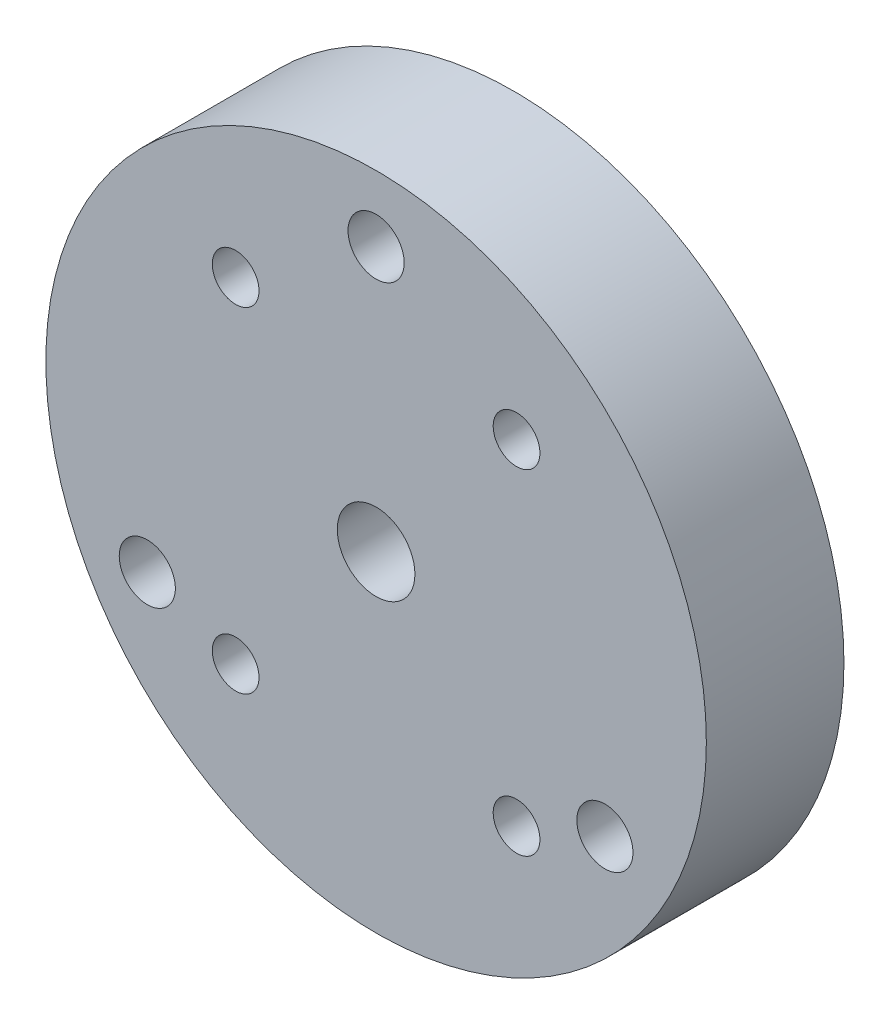
ISO-10303-21;
HEADER;
FILE_DESCRIPTION(('STEP AP214'),'2;1');
FILE_NAME('part.step','',(''),(''),'','','');
FILE_SCHEMA(('AUTOMOTIVE_DESIGN { 1 0 10303 214 1 1 1 1 }'));
ENDSEC;
DATA;
#1=APPLICATION_CONTEXT('core data for automotive mechanical design processes');
#2=APPLICATION_PROTOCOL_DEFINITION('international standard','automotive_design',2000,#1);
#3=PRODUCT_CONTEXT('',#1,'mechanical');
#4=PRODUCT('Part','Part','',(#3));
#5=PRODUCT_RELATED_PRODUCT_CATEGORY('part','',(#4));
#6=PRODUCT_DEFINITION_FORMATION('','',#4);
#7=PRODUCT_DEFINITION_CONTEXT('part definition',#1,'design');
#8=PRODUCT_DEFINITION('design','',#6,#7);
#9=PRODUCT_DEFINITION_SHAPE('','',#8);
#10=(LENGTH_UNIT() NAMED_UNIT(*) SI_UNIT(.MILLI.,.METRE.));
#11=(NAMED_UNIT(*) PLANE_ANGLE_UNIT() SI_UNIT($,.RADIAN.));
#12=(NAMED_UNIT(*) SI_UNIT($,.STERADIAN.) SOLID_ANGLE_UNIT());
#13=UNCERTAINTY_MEASURE_WITH_UNIT(LENGTH_MEASURE(1.E-05),#10,'distance_accuracy_value','');
#14=(GEOMETRIC_REPRESENTATION_CONTEXT(3) GLOBAL_UNCERTAINTY_ASSIGNED_CONTEXT((#13)) GLOBAL_UNIT_ASSIGNED_CONTEXT((#10,
#11,#12)) REPRESENTATION_CONTEXT('',''));
#15=CARTESIAN_POINT('',(0.,0.,0.));
#16=DIRECTION('',(0.,0.,1.));
#17=DIRECTION('',(1.,0.,0.));
#18=AXIS2_PLACEMENT_3D('',#15,#16,#17);
#19=CARTESIAN_POINT('',(0.,0.,25.));
#20=DIRECTION('',(0.,0.,1.));
#21=DIRECTION('',(1.,0.,0.));
#22=AXIS2_PLACEMENT_3D('',#19,#20,#21);
#23=PLANE('',#22);
#24=CARTESIAN_POINT('',(-41.5692193816529,-24.0000000000002,25.));
#25=DIRECTION('',(0.,0.,-1.));
#26=DIRECTION('',(-1.,0.,0.));
#27=AXIS2_PLACEMENT_3D('',#24,#25,#26);
#28=CIRCLE('',#27,5.09999999999999);
#29=CARTESIAN_POINT('',(-46.6692193816529,-24.0000000000002,25.));
#30=VERTEX_POINT('',#29);
#31=EDGE_CURVE('E388',#30,#30,#28,.T.);
#32=ORIENTED_EDGE('',*,*,#31,.T.);
#33=EDGE_LOOP('',(#32));
#34=FACE_BOUND('',#33,.T.);
#35=CARTESIAN_POINT('',(25.5186681045557,30.4119643918234,25.));
#36=DIRECTION('',(0.,0.,-1.));
#37=DIRECTION('',(-1.,0.,0.));
#38=AXIS2_PLACEMENT_3D('',#35,#36,#37);
#39=CIRCLE('',#38,4.24999999999999);
#40=CARTESIAN_POINT('',(21.2686681045557,30.4119643918234,25.));
#41=VERTEX_POINT('',#40);
#42=EDGE_CURVE('E400',#41,#41,#39,.T.);
#43=ORIENTED_EDGE('',*,*,#42,.T.);
#44=EDGE_LOOP('',(#43));
#45=FACE_BOUND('',#44,.T.);
#46=CARTESIAN_POINT('',(25.5186681045555,-30.4119643918236,25.));
#47=DIRECTION('',(0.,0.,-1.));
#48=DIRECTION('',(-1.,0.,0.));
#49=AXIS2_PLACEMENT_3D('',#46,#47,#48);
#50=CIRCLE('',#49,4.24999999999999);
#51=CARTESIAN_POINT('',(21.2686681045555,-30.4119643918236,25.));
#52=VERTEX_POINT('',#51);
#53=EDGE_CURVE('E412',#52,#52,#50,.T.);
#54=ORIENTED_EDGE('',*,*,#53,.T.);
#55=EDGE_LOOP('',(#54));
#56=FACE_BOUND('',#55,.T.);
#57=CARTESIAN_POINT('',(0.,0.,25.));
#58=DIRECTION('',(0.,0.,1.));
#59=DIRECTION('',(1.,0.,0.));
#60=AXIS2_PLACEMENT_3D('',#57,#58,#59);
#61=CIRCLE('',#60,7.05);
#62=CARTESIAN_POINT('',(7.05,0.,25.));
#63=VERTEX_POINT('',#62);
#64=EDGE_CURVE('E359',#63,#63,#61,.T.);
#65=ORIENTED_EDGE('',*,*,#64,.F.);
#66=EDGE_LOOP('',(#65));
#67=FACE_BOUND('',#66,.T.);
#68=CARTESIAN_POINT('',(0.,0.,25.));
#69=DIRECTION('',(0.,0.,1.));
#70=DIRECTION('',(1.,0.,0.));
#71=AXIS2_PLACEMENT_3D('',#68,#69,#70);
#72=CIRCLE('',#71,60.);
#73=CARTESIAN_POINT('',(60.,0.,25.));
#74=VERTEX_POINT('',#73);
#75=EDGE_CURVE('E10',#74,#74,#72,.T.);
#76=ORIENTED_EDGE('',*,*,#75,.T.);
#77=EDGE_LOOP('',(#76));
#78=FACE_BOUND('',#77,.T.);
#79=CARTESIAN_POINT('',(-25.5186681045557,-30.4119643918234,25.));
#80=DIRECTION('',(0.,0.,-1.));
#81=DIRECTION('',(-1.,0.,0.));
#82=AXIS2_PLACEMENT_3D('',#79,#80,#81);
#83=CIRCLE('',#82,4.24999999999999);
#84=CARTESIAN_POINT('',(-29.7686681045557,-30.4119643918234,25.));
#85=VERTEX_POINT('',#84);
#86=EDGE_CURVE('E418',#85,#85,#83,.T.);
#87=ORIENTED_EDGE('',*,*,#86,.T.);
#88=EDGE_LOOP('',(#87));
#89=FACE_BOUND('',#88,.T.);
#90=CARTESIAN_POINT('',(-25.5186681045554,30.4119643918236,25.));
#91=DIRECTION('',(0.,0.,-1.));
#92=DIRECTION('',(-1.,0.,0.));
#93=AXIS2_PLACEMENT_3D('',#90,#91,#92);
#94=CIRCLE('',#93,4.24999999999999);
#95=CARTESIAN_POINT('',(-29.7686681045554,30.4119643918236,25.));
#96=VERTEX_POINT('',#95);
#97=EDGE_CURVE('E406',#96,#96,#94,.T.);
#98=ORIENTED_EDGE('',*,*,#97,.T.);
#99=EDGE_LOOP('',(#98));
#100=FACE_BOUND('',#99,.T.);
#101=CARTESIAN_POINT('',(41.5692193816529,-24.0000000000002,25.));
#102=DIRECTION('',(0.,0.,-1.));
#103=DIRECTION('',(-1.,0.,0.));
#104=AXIS2_PLACEMENT_3D('',#101,#102,#103);
#105=CIRCLE('',#104,5.09999999999999);
#106=CARTESIAN_POINT('',(36.4692193816529,-24.0000000000002,25.));
#107=VERTEX_POINT('',#106);
#108=EDGE_CURVE('E394',#107,#107,#105,.T.);
#109=ORIENTED_EDGE('',*,*,#108,.T.);
#110=EDGE_LOOP('',(#109));
#111=FACE_BOUND('',#110,.T.);
#112=CARTESIAN_POINT('',(0.,48.,25.));
#113=DIRECTION('',(0.,0.,-1.));
#114=DIRECTION('',(-1.,0.,0.));
#115=AXIS2_PLACEMENT_3D('',#112,#113,#114);
#116=CIRCLE('',#115,5.09999999999999);
#117=CARTESIAN_POINT('',(-5.09999999999999,48.,25.));
#118=VERTEX_POINT('',#117);
#119=EDGE_CURVE('E380',#118,#118,#116,.T.);
#120=ORIENTED_EDGE('',*,*,#119,.T.);
#121=EDGE_LOOP('',(#120));
#122=FACE_BOUND('',#121,.T.);
#123=ADVANCED_FACE('F346',(#34,#45,#56,#67,#78,#89,#100,#111,#122),#23,.T.);
#124=CARTESIAN_POINT('',(0.,0.,25.));
#125=DIRECTION('',(0.,0.,-1.));
#126=DIRECTION('',(-1.,0.,0.));
#127=AXIS2_PLACEMENT_3D('',#124,#125,#126);
#128=CYLINDRICAL_SURFACE('',#127,7.05);
#129=ORIENTED_EDGE('',*,*,#64,.T.);
#130=EDGE_LOOP('',(#129));
#131=FACE_BOUND('',#130,.T.);
#132=CARTESIAN_POINT('',(0.,0.,2.4));
#133=DIRECTION('',(0.,0.,-1.));
#134=DIRECTION('',(-1.,0.,0.));
#135=AXIS2_PLACEMENT_3D('',#132,#133,#134);
#136=CIRCLE('',#135,7.05);
#137=CARTESIAN_POINT('',(-7.05,0.,2.4));
#138=VERTEX_POINT('',#137);
#139=EDGE_CURVE('E363',#138,#138,#136,.T.);
#140=ORIENTED_EDGE('',*,*,#139,.T.);
#141=EDGE_LOOP('',(#140));
#142=FACE_BOUND('',#141,.T.);
#143=ADVANCED_FACE('F431',(#131,#142),#128,.F.);
#144=CARTESIAN_POINT('',(0.,0.,0.));
#145=DIRECTION('',(0.,0.,1.));
#146=DIRECTION('',(1.,0.,0.));
#147=AXIS2_PLACEMENT_3D('',#144,#145,#146);
#148=PLANE('',#147);
#149=CARTESIAN_POINT('',(0.,48.,0.));
#150=DIRECTION('',(0.,0.,-1.));
#151=DIRECTION('',(-1.,0.,0.));
#152=AXIS2_PLACEMENT_3D('',#149,#150,#151);
#153=CIRCLE('',#152,5.09999999999999);
#154=CARTESIAN_POINT('',(-5.09999999999999,48.,0.));
#155=VERTEX_POINT('',#154);
#156=EDGE_CURVE('E385',#155,#155,#153,.T.);
#157=ORIENTED_EDGE('',*,*,#156,.F.);
#158=EDGE_LOOP('',(#157));
#159=FACE_BOUND('',#158,.T.);
#160=CARTESIAN_POINT('',(-41.5692193816529,-24.0000000000002,0.));
#161=DIRECTION('',(0.,0.,-1.));
#162=DIRECTION('',(-1.,0.,0.));
#163=AXIS2_PLACEMENT_3D('',#160,#161,#162);
#164=CIRCLE('',#163,5.09999999999999);
#165=CARTESIAN_POINT('',(-46.6692193816529,-24.0000000000002,0.));
#166=VERTEX_POINT('',#165);
#167=EDGE_CURVE('E391',#166,#166,#164,.T.);
#168=ORIENTED_EDGE('',*,*,#167,.F.);
#169=EDGE_LOOP('',(#168));
#170=FACE_BOUND('',#169,.T.);
#171=CARTESIAN_POINT('',(41.5692193816529,-24.0000000000002,0.));
#172=DIRECTION('',(0.,0.,-1.));
#173=DIRECTION('',(-1.,0.,0.));
#174=AXIS2_PLACEMENT_3D('',#171,#172,#173);
#175=CIRCLE('',#174,5.09999999999999);
#176=CARTESIAN_POINT('',(36.469219381653,-24.0000000000002,0.));
#177=VERTEX_POINT('',#176);
#178=EDGE_CURVE('E397',#177,#177,#175,.T.);
#179=ORIENTED_EDGE('',*,*,#178,.F.);
#180=EDGE_LOOP('',(#179));
#181=FACE_BOUND('',#180,.T.);
#182=CARTESIAN_POINT('',(25.5186681045557,30.4119643918234,0.));
#183=DIRECTION('',(0.,0.,-1.));
#184=DIRECTION('',(-1.,0.,0.));
#185=AXIS2_PLACEMENT_3D('',#182,#183,#184);
#186=CIRCLE('',#185,4.24999999999999);
#187=CARTESIAN_POINT('',(21.2686681045557,30.4119643918234,0.));
#188=VERTEX_POINT('',#187);
#189=EDGE_CURVE('E403',#188,#188,#186,.T.);
#190=ORIENTED_EDGE('',*,*,#189,.F.);
#191=EDGE_LOOP('',(#190));
#192=FACE_BOUND('',#191,.T.);
#193=CARTESIAN_POINT('',(-25.5186681045554,30.4119643918236,0.));
#194=DIRECTION('',(0.,0.,-1.));
#195=DIRECTION('',(-1.,0.,0.));
#196=AXIS2_PLACEMENT_3D('',#193,#194,#195);
#197=CIRCLE('',#196,4.24999999999999);
#198=CARTESIAN_POINT('',(-29.7686681045554,30.4119643918236,0.));
#199=VERTEX_POINT('',#198);
#200=EDGE_CURVE('E409',#199,#199,#197,.T.);
#201=ORIENTED_EDGE('',*,*,#200,.F.);
#202=EDGE_LOOP('',(#201));
#203=FACE_BOUND('',#202,.T.);
#204=CARTESIAN_POINT('',(25.5186681045555,-30.4119643918236,0.));
#205=DIRECTION('',(0.,0.,-1.));
#206=DIRECTION('',(-1.,0.,0.));
#207=AXIS2_PLACEMENT_3D('',#204,#205,#206);
#208=CIRCLE('',#207,4.24999999999999);
#209=CARTESIAN_POINT('',(21.2686681045555,-30.4119643918236,0.));
#210=VERTEX_POINT('',#209);
#211=EDGE_CURVE('E415',#210,#210,#208,.T.);
#212=ORIENTED_EDGE('',*,*,#211,.F.);
#213=EDGE_LOOP('',(#212));
#214=FACE_BOUND('',#213,.T.);
#215=CARTESIAN_POINT('',(-25.5186681045557,-30.4119643918234,0.));
#216=DIRECTION('',(0.,0.,-1.));
#217=DIRECTION('',(-1.,0.,0.));
#218=AXIS2_PLACEMENT_3D('',#215,#216,#217);
#219=CIRCLE('',#218,4.24999999999999);
#220=CARTESIAN_POINT('',(-29.7686681045557,-30.4119643918234,0.));
#221=VERTEX_POINT('',#220);
#222=EDGE_CURVE('E421',#221,#221,#219,.T.);
#223=ORIENTED_EDGE('',*,*,#222,.F.);
#224=EDGE_LOOP('',(#223));
#225=FACE_BOUND('',#224,.T.);
#226=CARTESIAN_POINT('',(0.,0.,0.));
#227=DIRECTION('',(0.,0.,-1.));
#228=DIRECTION('',(-1.,0.,0.));
#229=AXIS2_PLACEMENT_3D('',#226,#227,#228);
#230=CIRCLE('',#229,30.15);
#231=CARTESIAN_POINT('',(-30.15,0.,0.));
#232=VERTEX_POINT('',#231);
#233=EDGE_CURVE('E424',#232,#232,#230,.T.);
#234=ORIENTED_EDGE('',*,*,#233,.F.);
#235=EDGE_LOOP('',(#234));
#236=FACE_BOUND('',#235,.T.);
#237=CARTESIAN_POINT('',(0.,0.,0.));
#238=DIRECTION('',(0.,0.,1.));
#239=DIRECTION('',(1.,0.,0.));
#240=AXIS2_PLACEMENT_3D('',#237,#238,#239);
#241=CIRCLE('',#240,60.);
#242=CARTESIAN_POINT('',(60.,0.,0.));
#243=VERTEX_POINT('',#242);
#244=EDGE_CURVE('E354',#243,#243,#241,.T.);
#245=ORIENTED_EDGE('',*,*,#244,.F.);
#246=EDGE_LOOP('',(#245));
#247=FACE_BOUND('',#246,.T.);
#248=ADVANCED_FACE('F453',(#159,#170,#181,#192,#203,#214,#225,#236,#247),#148,.F.);
#249=CARTESIAN_POINT('',(0.,0.,25.));
#250=DIRECTION('',(0.,0.,-1.));
#251=DIRECTION('',(-1.,0.,0.));
#252=AXIS2_PLACEMENT_3D('',#249,#250,#251);
#253=CYLINDRICAL_SURFACE('',#252,60.);
#254=ORIENTED_EDGE('',*,*,#75,.F.);
#255=EDGE_LOOP('',(#254));
#256=FACE_BOUND('',#255,.T.);
#257=ORIENTED_EDGE('',*,*,#244,.T.);
#258=EDGE_LOOP('',(#257));
#259=FACE_BOUND('',#258,.T.);
#260=ADVANCED_FACE('F348',(#256,#259),#253,.T.);
#261=CARTESIAN_POINT('',(0.,0.,2.4));
#262=DIRECTION('',(0.,0.,-1.));
#263=DIRECTION('',(-1.,0.,0.));
#264=AXIS2_PLACEMENT_3D('',#261,#262,#263);
#265=CYLINDRICAL_SURFACE('',#264,30.15);
#266=CARTESIAN_POINT('',(0.,0.,2.05581131534328));
#267=DIRECTION('',(0.,0.,1.));
#268=DIRECTION('',(1.,0.,0.));
#269=AXIS2_PLACEMENT_3D('',#266,#267,#268);
#270=CIRCLE('',#269,30.15);
#271=CARTESIAN_POINT('',(30.15,0.,2.05581131534328));
#272=VERTEX_POINT('',#271);
#273=EDGE_CURVE('E371',#272,#272,#270,.T.);
#274=ORIENTED_EDGE('',*,*,#273,.T.);
#275=EDGE_LOOP('',(#274));
#276=FACE_BOUND('',#275,.T.);
#277=ORIENTED_EDGE('',*,*,#233,.T.);
#278=EDGE_LOOP('',(#277));
#279=FACE_BOUND('',#278,.T.);
#280=ADVANCED_FACE('F474',(#276,#279),#265,.F.);
#281=CARTESIAN_POINT('',(0.,0.,2.4));
#282=DIRECTION('',(0.,0.,-1.));
#283=DIRECTION('',(-1.,0.,0.));
#284=AXIS2_PLACEMENT_3D('',#281,#282,#283);
#285=PLANE('',#284);
#286=CARTESIAN_POINT('',(0.,0.,2.4));
#287=DIRECTION('',(0.,0.,1.));
#288=DIRECTION('',(1.,0.,0.));
#289=AXIS2_PLACEMENT_3D('',#286,#287,#288);
#290=CIRCLE('',#289,29.7873241427729);
#291=CARTESIAN_POINT('',(29.7873241427729,0.,2.4));
#292=VERTEX_POINT('',#291);
#293=EDGE_CURVE('E366',#292,#292,#290,.T.);
#294=ORIENTED_EDGE('',*,*,#293,.F.);
#295=EDGE_LOOP('',(#294));
#296=FACE_BOUND('',#295,.T.);
#297=ORIENTED_EDGE('',*,*,#139,.F.);
#298=EDGE_LOOP('',(#297));
#299=FACE_BOUND('',#298,.T.);
#300=ADVANCED_FACE('F480',(#296,#299),#285,.T.);
#301=CARTESIAN_POINT('',(-25.5186681045557,-30.4119643918234,0.));
#302=DIRECTION('',(0.,0.,-1.));
#303=DIRECTION('',(-1.,0.,0.));
#304=AXIS2_PLACEMENT_3D('',#301,#302,#303);
#305=CYLINDRICAL_SURFACE('',#304,4.24999999999999);
#306=ORIENTED_EDGE('',*,*,#86,.F.);
#307=EDGE_LOOP('',(#306));
#308=FACE_BOUND('',#307,.T.);
#309=ORIENTED_EDGE('',*,*,#222,.T.);
#310=EDGE_LOOP('',(#309));
#311=FACE_BOUND('',#310,.T.);
#312=ADVANCED_FACE('F486',(#308,#311),#305,.F.);
#313=CARTESIAN_POINT('',(25.5186681045555,-30.4119643918236,0.));
#314=DIRECTION('',(0.,0.,-1.));
#315=DIRECTION('',(-1.,0.,0.));
#316=AXIS2_PLACEMENT_3D('',#313,#314,#315);
#317=CYLINDRICAL_SURFACE('',#316,4.24999999999999);
#318=ORIENTED_EDGE('',*,*,#53,.F.);
#319=EDGE_LOOP('',(#318));
#320=FACE_BOUND('',#319,.T.);
#321=ORIENTED_EDGE('',*,*,#211,.T.);
#322=EDGE_LOOP('',(#321));
#323=FACE_BOUND('',#322,.T.);
#324=ADVANCED_FACE('F513',(#320,#323),#317,.F.);
#325=CARTESIAN_POINT('',(-25.5186681045554,30.4119643918236,0.));
#326=DIRECTION('',(0.,0.,-1.));
#327=DIRECTION('',(-1.,0.,0.));
#328=AXIS2_PLACEMENT_3D('',#325,#326,#327);
#329=CYLINDRICAL_SURFACE('',#328,4.24999999999999);
#330=ORIENTED_EDGE('',*,*,#97,.F.);
#331=EDGE_LOOP('',(#330));
#332=FACE_BOUND('',#331,.T.);
#333=ORIENTED_EDGE('',*,*,#200,.T.);
#334=EDGE_LOOP('',(#333));
#335=FACE_BOUND('',#334,.T.);
#336=ADVANCED_FACE('F517',(#332,#335),#329,.F.);
#337=CARTESIAN_POINT('',(25.5186681045557,30.4119643918234,0.));
#338=DIRECTION('',(0.,0.,-1.));
#339=DIRECTION('',(-1.,0.,0.));
#340=AXIS2_PLACEMENT_3D('',#337,#338,#339);
#341=CYLINDRICAL_SURFACE('',#340,4.24999999999999);
#342=ORIENTED_EDGE('',*,*,#42,.F.);
#343=EDGE_LOOP('',(#342));
#344=FACE_BOUND('',#343,.T.);
#345=ORIENTED_EDGE('',*,*,#189,.T.);
#346=EDGE_LOOP('',(#345));
#347=FACE_BOUND('',#346,.T.);
#348=ADVANCED_FACE('F521',(#344,#347),#341,.F.);
#349=CARTESIAN_POINT('',(41.5692193816529,-24.0000000000002,0.));
#350=DIRECTION('',(0.,0.,-1.));
#351=DIRECTION('',(-1.,0.,0.));
#352=AXIS2_PLACEMENT_3D('',#349,#350,#351);
#353=CYLINDRICAL_SURFACE('',#352,5.09999999999999);
#354=ORIENTED_EDGE('',*,*,#108,.F.);
#355=EDGE_LOOP('',(#354));
#356=FACE_BOUND('',#355,.T.);
#357=ORIENTED_EDGE('',*,*,#178,.T.);
#358=EDGE_LOOP('',(#357));
#359=FACE_BOUND('',#358,.T.);
#360=ADVANCED_FACE('F525',(#356,#359),#353,.F.);
#361=CARTESIAN_POINT('',(-41.5692193816529,-24.0000000000002,0.));
#362=DIRECTION('',(0.,0.,-1.));
#363=DIRECTION('',(-1.,0.,0.));
#364=AXIS2_PLACEMENT_3D('',#361,#362,#363);
#365=CYLINDRICAL_SURFACE('',#364,5.09999999999999);
#366=ORIENTED_EDGE('',*,*,#31,.F.);
#367=EDGE_LOOP('',(#366));
#368=FACE_BOUND('',#367,.T.);
#369=ORIENTED_EDGE('',*,*,#167,.T.);
#370=EDGE_LOOP('',(#369));
#371=FACE_BOUND('',#370,.T.);
#372=ADVANCED_FACE('F449',(#368,#371),#365,.F.);
#373=CARTESIAN_POINT('',(0.,48.,0.));
#374=DIRECTION('',(0.,0.,-1.));
#375=DIRECTION('',(-1.,0.,0.));
#376=AXIS2_PLACEMENT_3D('',#373,#374,#375);
#377=CYLINDRICAL_SURFACE('',#376,5.09999999999999);
#378=ORIENTED_EDGE('',*,*,#119,.F.);
#379=EDGE_LOOP('',(#378));
#380=FACE_BOUND('',#379,.T.);
#381=ORIENTED_EDGE('',*,*,#156,.T.);
#382=EDGE_LOOP('',(#381));
#383=FACE_BOUND('',#382,.T.);
#384=ADVANCED_FACE('F445',(#380,#383),#377,.F.);
#385=CARTESIAN_POINT('',(0.,0.,2.22768447314081));
#386=DIRECTION('',(0.,0.,1.));
#387=DIRECTION('',(1.,0.,0.));
#388=AXIS2_PLACEMENT_3D('',#385,#386,#387);
#389=TOROIDAL_SURFACE('',#388,29.9684521615973,0.25);
#390=CARTESIAN_POINT('',(0.,0.,2.4));
#391=DIRECTION('',(0.,0.,-1.));
#392=DIRECTION('',(-1.,0.,0.));
#393=AXIS2_PLACEMENT_3D('',#390,#391,#392);
#394=CIRCLE('',#393,30.1495801804216);
#395=CARTESIAN_POINT('',(-30.1495801804216,0.,2.4));
#396=VERTEX_POINT('',#395);
#397=EDGE_CURVE('E350',#396,#396,#394,.T.);
#398=ORIENTED_EDGE('',*,*,#397,.T.);
#399=EDGE_LOOP('',(#398));
#400=FACE_BOUND('',#399,.T.);
#401=ORIENTED_EDGE('',*,*,#293,.T.);
#402=EDGE_LOOP('',(#401));
#403=FACE_BOUND('',#402,.T.);
#404=ADVANCED_FACE('F448',(#400,#403),#389,.F.);
#405=ORIENTED_EDGE('',*,*,#397,.F.);
#406=EDGE_LOOP('',(#405));
#407=FACE_BOUND('',#406,.T.);
#408=CARTESIAN_POINT('',(0.,0.,2.4));
#409=DIRECTION('',(0.,0.,-1.));
#410=DIRECTION('',(-1.,0.,0.));
#411=AXIS2_PLACEMENT_3D('',#408,#409,#410);
#412=CIRCLE('',#411,30.15);
#413=CARTESIAN_POINT('',(-30.15,0.,2.4));
#414=VERTEX_POINT('',#413);
#415=EDGE_CURVE('E365',#414,#414,#412,.T.);
#416=ORIENTED_EDGE('',*,*,#415,.T.);
#417=EDGE_LOOP('',(#416));
#418=FACE_BOUND('',#417,.T.);
#419=ADVANCED_FACE('F489',(#407,#418),#285,.T.);
#420=CARTESIAN_POINT('',(0.,0.,2.39955763093835));
#421=DIRECTION('',(0.,0.,-1.));
#422=DIRECTION('',(-1.,0.,0.));
#423=AXIS2_PLACEMENT_3D('',#420,#421,#422);
#424=CIRCLE('',#423,30.15);
#425=CARTESIAN_POINT('',(-30.15,0.,2.39955763093835));
#426=VERTEX_POINT('',#425);
#427=EDGE_CURVE('E375',#426,#426,#424,.T.);
#428=ORIENTED_EDGE('',*,*,#427,.T.);
#429=EDGE_LOOP('',(#428));
#430=FACE_BOUND('',#429,.T.);
#431=ORIENTED_EDGE('',*,*,#415,.F.);
#432=EDGE_LOOP('',(#431));
#433=FACE_BOUND('',#432,.T.);
#434=ADVANCED_FACE('F482',(#430,#433),#265,.F.);
#435=ORIENTED_EDGE('',*,*,#273,.F.);
#436=EDGE_LOOP('',(#435));
#437=FACE_BOUND('',#436,.T.);
#438=ORIENTED_EDGE('',*,*,#427,.F.);
#439=EDGE_LOOP('',(#438));
#440=FACE_BOUND('',#439,.T.);
#441=ADVANCED_FACE('F493',(#437,#440),#389,.F.);
#442=CLOSED_SHELL('',(#123,#143,#248,#260,#280,#300,#312,#324,#336,#348,#360,#372,#384,#404,
#419,#434,#441));
#443=MANIFOLD_SOLID_BREP('B2',#442);
#444=ADVANCED_BREP_SHAPE_REPRESENTATION('',(#18,#443),#14);
#445=SHAPE_DEFINITION_REPRESENTATION(#9,#444);
ENDSEC;
END-ISO-10303-21;
